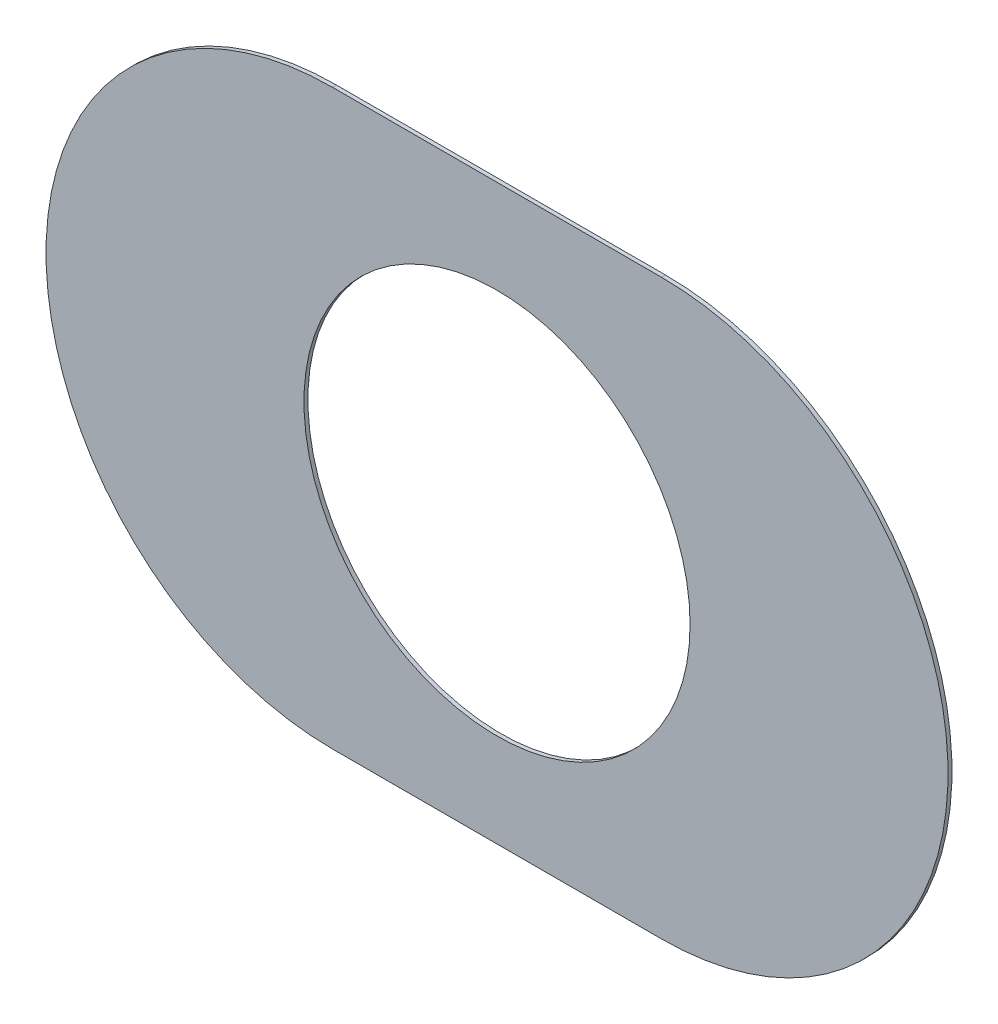
ISO-10303-21;
HEADER;
FILE_DESCRIPTION(('STEP AP214'),'2;1');
FILE_NAME('part.step','',(''),(''),'','','');
FILE_SCHEMA(('AUTOMOTIVE_DESIGN { 1 0 10303 214 1 1 1 1 }'));
ENDSEC;
DATA;
#1=APPLICATION_CONTEXT('core data for automotive mechanical design processes');
#2=APPLICATION_PROTOCOL_DEFINITION('international standard','automotive_design',2000,#1);
#3=PRODUCT_CONTEXT('',#1,'mechanical');
#4=PRODUCT('Part','Part','',(#3));
#5=PRODUCT_RELATED_PRODUCT_CATEGORY('part','',(#4));
#6=PRODUCT_DEFINITION_FORMATION('','',#4);
#7=PRODUCT_DEFINITION_CONTEXT('part definition',#1,'design');
#8=PRODUCT_DEFINITION('design','',#6,#7);
#9=PRODUCT_DEFINITION_SHAPE('','',#8);
#10=(LENGTH_UNIT() NAMED_UNIT(*) SI_UNIT(.MILLI.,.METRE.));
#11=(NAMED_UNIT(*) PLANE_ANGLE_UNIT() SI_UNIT($,.RADIAN.));
#12=(NAMED_UNIT(*) SI_UNIT($,.STERADIAN.) SOLID_ANGLE_UNIT());
#13=UNCERTAINTY_MEASURE_WITH_UNIT(LENGTH_MEASURE(1.E-05),#10,'distance_accuracy_value','');
#14=(GEOMETRIC_REPRESENTATION_CONTEXT(3) GLOBAL_UNCERTAINTY_ASSIGNED_CONTEXT((#13)) GLOBAL_UNIT_ASSIGNED_CONTEXT((#10,
#11,#12)) REPRESENTATION_CONTEXT('',''));
#15=CARTESIAN_POINT('',(0.,0.,0.));
#16=DIRECTION('',(0.,0.,1.));
#17=DIRECTION('',(1.,0.,0.));
#18=AXIS2_PLACEMENT_3D('',#15,#16,#17);
#19=CARTESIAN_POINT('',(24.3000003427268,29.7800006854535,0.));
#20=DIRECTION('',(0.,0.,1.));
#21=DIRECTION('',(1.,0.,0.));
#22=AXIS2_PLACEMENT_3D('',#19,#20,#21);
#23=PLANE('',#22);
#24=CARTESIAN_POINT('',(24.3000003427268,29.7800006854535,0.));
#25=DIRECTION('',(0.,0.,-1.));
#26=DIRECTION('',(-1.,0.,0.));
#27=AXIS2_PLACEMENT_3D('',#24,#25,#26);
#28=CIRCLE('',#27,0.49);
#29=CARTESIAN_POINT('',(24.7900003427268,29.7800006854535,0.));
#30=VERTEX_POINT('',#29);
#31=EDGE_CURVE('E99',#30,#30,#28,.T.);
#32=ORIENTED_EDGE('',*,*,#31,.T.);
#33=EDGE_LOOP('',(#32));
#34=FACE_BOUND('',#33,.T.);
#35=CARTESIAN_POINT('',(23.8825938881802,29.7800006854535,0.));
#36=DIRECTION('',(0.,0.,1.));
#37=DIRECTION('',(0.,1.,0.));
#38=AXIS2_PLACEMENT_3D('',#35,#36,#37);
#39=CIRCLE('',#38,0.727257121659981);
#40=CARTESIAN_POINT('',(23.8825938881802,30.5072578071135,0.));
#41=VERTEX_POINT('',#40);
#42=CARTESIAN_POINT('',(23.8825938881802,29.0527435637935,0.));
#43=VERTEX_POINT('',#42);
#44=EDGE_CURVE('E28',#41,#43,#39,.T.);
#45=ORIENTED_EDGE('',*,*,#44,.T.);
#46=DIRECTION('',(1.,0.,0.));
#47=VECTOR('',#46,1.);
#48=CARTESIAN_POINT('',(23.8825938881802,29.0527435637935,0.));
#49=LINE('',#48,#47);
#50=CARTESIAN_POINT('',(24.7174067972734,29.0527435637935,0.));
#51=VERTEX_POINT('',#50);
#52=EDGE_CURVE('E119',#43,#51,#49,.T.);
#53=ORIENTED_EDGE('',*,*,#52,.T.);
#54=CARTESIAN_POINT('',(24.7174067972734,29.7800006854535,0.));
#55=DIRECTION('',(0.,0.,1.));
#56=DIRECTION('',(0.,-1.,0.));
#57=AXIS2_PLACEMENT_3D('',#54,#55,#56);
#58=CIRCLE('',#57,0.727257121659981);
#59=CARTESIAN_POINT('',(24.7174067972734,30.5072578071135,0.));
#60=VERTEX_POINT('',#59);
#61=EDGE_CURVE('E74',#51,#60,#58,.T.);
#62=ORIENTED_EDGE('',*,*,#61,.T.);
#63=DIRECTION('',(-1.,0.,0.));
#64=VECTOR('',#63,1.);
#65=CARTESIAN_POINT('',(24.7174067972734,30.5072578071135,0.));
#66=LINE('',#65,#64);
#67=EDGE_CURVE('E92',#60,#41,#66,.T.);
#68=ORIENTED_EDGE('',*,*,#67,.T.);
#69=EDGE_LOOP('',(#45,#53,#62,#68));
#70=FACE_BOUND('',#69,.T.);
#71=ADVANCED_FACE('F17',(#34,#70),#23,.T.);
#72=CARTESIAN_POINT('',(24.3000003427268,29.7800006854535,-0.01));
#73=DIRECTION('',(0.,0.,1.));
#74=DIRECTION('',(1.,0.,0.));
#75=AXIS2_PLACEMENT_3D('',#72,#73,#74);
#76=PLANE('',#75);
#77=CARTESIAN_POINT('',(24.3000003427268,29.7800006854535,-0.01));
#78=DIRECTION('',(0.,0.,-1.));
#79=DIRECTION('',(-1.,0.,0.));
#80=AXIS2_PLACEMENT_3D('',#77,#78,#79);
#81=CIRCLE('',#80,0.49);
#82=CARTESIAN_POINT('',(24.7900003427268,29.7800006854535,-0.01));
#83=VERTEX_POINT('',#82);
#84=EDGE_CURVE('E113',#83,#83,#81,.T.);
#85=ORIENTED_EDGE('',*,*,#84,.F.);
#86=EDGE_LOOP('',(#85));
#87=FACE_BOUND('',#86,.T.);
#88=CARTESIAN_POINT('',(23.8825938881802,29.7800006854535,-0.01));
#89=DIRECTION('',(0.,0.,1.));
#90=DIRECTION('',(0.,1.,0.));
#91=AXIS2_PLACEMENT_3D('',#88,#89,#90);
#92=CIRCLE('',#91,0.727257121659981);
#93=CARTESIAN_POINT('',(23.8825938881802,30.5072578071135,-0.01));
#94=VERTEX_POINT('',#93);
#95=CARTESIAN_POINT('',(23.8825938881802,29.0527435637935,-0.01));
#96=VERTEX_POINT('',#95);
#97=EDGE_CURVE('E11',#94,#96,#92,.T.);
#98=ORIENTED_EDGE('',*,*,#97,.F.);
#99=DIRECTION('',(-1.,0.,0.));
#100=VECTOR('',#99,1.);
#101=CARTESIAN_POINT('',(24.7174067972734,30.5072578071135,-0.01));
#102=LINE('',#101,#100);
#103=CARTESIAN_POINT('',(24.7174067972734,30.5072578071135,-0.01));
#104=VERTEX_POINT('',#103);
#105=EDGE_CURVE('E94',#104,#94,#102,.T.);
#106=ORIENTED_EDGE('',*,*,#105,.F.);
#107=CARTESIAN_POINT('',(24.7174067972734,29.7800006854535,-0.01));
#108=DIRECTION('',(0.,0.,1.));
#109=DIRECTION('',(0.,-1.,0.));
#110=AXIS2_PLACEMENT_3D('',#107,#108,#109);
#111=CIRCLE('',#110,0.727257121659981);
#112=CARTESIAN_POINT('',(24.7174067972734,29.0527435637935,-0.01));
#113=VERTEX_POINT('',#112);
#114=EDGE_CURVE('E122',#113,#104,#111,.T.);
#115=ORIENTED_EDGE('',*,*,#114,.F.);
#116=DIRECTION('',(1.,0.,0.));
#117=VECTOR('',#116,1.);
#118=CARTESIAN_POINT('',(23.8825938881802,29.0527435637935,-0.01));
#119=LINE('',#118,#117);
#120=EDGE_CURVE('E21',#96,#113,#119,.T.);
#121=ORIENTED_EDGE('',*,*,#120,.F.);
#122=EDGE_LOOP('',(#98,#106,#115,#121));
#123=FACE_BOUND('',#122,.T.);
#124=ADVANCED_FACE('F141',(#87,#123),#76,.F.);
#125=CARTESIAN_POINT('',(23.8825938881802,29.7800006854535,0.));
#126=DIRECTION('',(0.,0.,1.));
#127=DIRECTION('',(0.,1.,0.));
#128=AXIS2_PLACEMENT_3D('',#125,#126,#127);
#129=CYLINDRICAL_SURFACE('',#128,0.727257121659981);
#130=ORIENTED_EDGE('',*,*,#44,.F.);
#131=DIRECTION('',(0.,0.,-1.));
#132=VECTOR('',#131,1.);
#133=CARTESIAN_POINT('',(23.8825938881802,30.5072578071135,0.));
#134=LINE('',#133,#132);
#135=EDGE_CURVE('E81',#41,#94,#134,.T.);
#136=ORIENTED_EDGE('',*,*,#135,.T.);
#137=ORIENTED_EDGE('',*,*,#97,.T.);
#138=DIRECTION('',(0.,0.,-1.));
#139=VECTOR('',#138,1.);
#140=CARTESIAN_POINT('',(23.8825938881802,29.0527435637935,0.));
#141=LINE('',#140,#139);
#142=EDGE_CURVE('E84',#43,#96,#141,.T.);
#143=ORIENTED_EDGE('',*,*,#142,.F.);
#144=EDGE_LOOP('',(#130,#136,#137,#143));
#145=FACE_BOUND('',#144,.T.);
#146=ADVANCED_FACE('F80',(#145),#129,.T.);
#147=CARTESIAN_POINT('',(23.8825938881802,29.0527435637935,0.));
#148=DIRECTION('',(0.,1.,0.));
#149=DIRECTION('',(1.,0.,0.));
#150=AXIS2_PLACEMENT_3D('',#147,#148,#149);
#151=PLANE('',#150);
#152=ORIENTED_EDGE('',*,*,#52,.F.);
#153=ORIENTED_EDGE('',*,*,#142,.T.);
#154=ORIENTED_EDGE('',*,*,#120,.T.);
#155=DIRECTION('',(0.,0.,-1.));
#156=VECTOR('',#155,1.);
#157=CARTESIAN_POINT('',(24.7174067972734,29.0527435637935,0.));
#158=LINE('',#157,#156);
#159=EDGE_CURVE('E110',#51,#113,#158,.T.);
#160=ORIENTED_EDGE('',*,*,#159,.F.);
#161=EDGE_LOOP('',(#152,#153,#154,#160));
#162=FACE_BOUND('',#161,.T.);
#163=ADVANCED_FACE('F144',(#162),#151,.F.);
#164=CARTESIAN_POINT('',(24.7174067972734,29.7800006854535,0.));
#165=DIRECTION('',(0.,0.,1.));
#166=DIRECTION('',(0.,-1.,0.));
#167=AXIS2_PLACEMENT_3D('',#164,#165,#166);
#168=CYLINDRICAL_SURFACE('',#167,0.727257121659981);
#169=ORIENTED_EDGE('',*,*,#61,.F.);
#170=ORIENTED_EDGE('',*,*,#159,.T.);
#171=ORIENTED_EDGE('',*,*,#114,.T.);
#172=DIRECTION('',(0.,0.,-1.));
#173=VECTOR('',#172,1.);
#174=CARTESIAN_POINT('',(24.7174067972734,30.5072578071135,0.));
#175=LINE('',#174,#173);
#176=EDGE_CURVE('E98',#60,#104,#175,.T.);
#177=ORIENTED_EDGE('',*,*,#176,.F.);
#178=EDGE_LOOP('',(#169,#170,#171,#177));
#179=FACE_BOUND('',#178,.T.);
#180=ADVANCED_FACE('F139',(#179),#168,.T.);
#181=CARTESIAN_POINT('',(24.7174067972734,30.5072578071135,0.));
#182=DIRECTION('',(0.,-1.,0.));
#183=DIRECTION('',(0.,0.,-1.));
#184=AXIS2_PLACEMENT_3D('',#181,#182,#183);
#185=PLANE('',#184);
#186=ORIENTED_EDGE('',*,*,#67,.F.);
#187=ORIENTED_EDGE('',*,*,#176,.T.);
#188=ORIENTED_EDGE('',*,*,#105,.T.);
#189=ORIENTED_EDGE('',*,*,#135,.F.);
#190=EDGE_LOOP('',(#186,#187,#188,#189));
#191=FACE_BOUND('',#190,.T.);
#192=ADVANCED_FACE('F90',(#191),#185,.F.);
#193=CARTESIAN_POINT('',(24.3000003427268,29.7800006854535,0.));
#194=DIRECTION('',(0.,0.,1.));
#195=DIRECTION('',(-1.,0.,0.));
#196=AXIS2_PLACEMENT_3D('',#193,#194,#195);
#197=CYLINDRICAL_SURFACE('',#196,0.49);
#198=ORIENTED_EDGE('',*,*,#84,.T.);
#199=DIRECTION('',(0.,0.,1.));
#200=VECTOR('',#199,1.);
#201=CARTESIAN_POINT('',(24.7900003427268,29.7800006854535,0.));
#202=LINE('',#201,#200);
#203=EDGE_CURVE('E106',#83,#30,#202,.T.);
#204=ORIENTED_EDGE('',*,*,#203,.T.);
#205=ORIENTED_EDGE('',*,*,#31,.F.);
#206=ORIENTED_EDGE('',*,*,#203,.F.);
#207=EDGE_LOOP('',(#198,#204,#205,#206));
#208=FACE_BOUND('',#207,.T.);
#209=ADVANCED_FACE('F19',(#208),#197,.F.);
#210=CLOSED_SHELL('',(#71,#124,#146,#163,#180,#192,#209));
#211=MANIFOLD_SOLID_BREP('B1',#210);
#212=ADVANCED_BREP_SHAPE_REPRESENTATION('',(#18,#211),#14);
#213=SHAPE_DEFINITION_REPRESENTATION(#9,#212);
ENDSEC;
END-ISO-10303-21;
